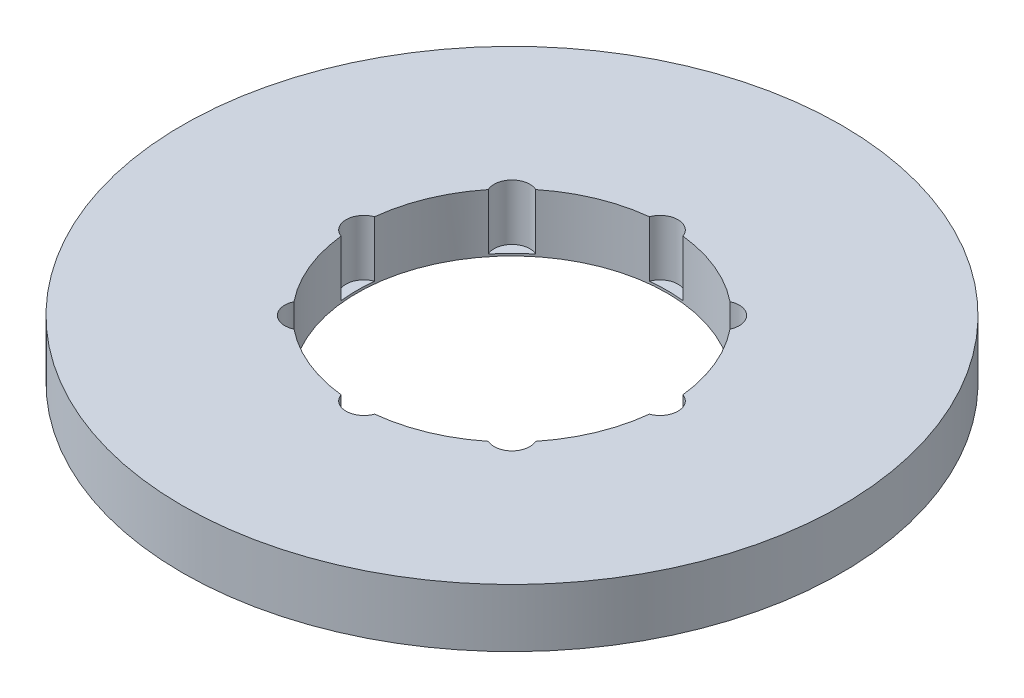
ISO-10303-21;
HEADER;
FILE_DESCRIPTION(('STEP AP214'),'2;1');
FILE_NAME('part.step','',(''),(''),'','','');
FILE_SCHEMA(('AUTOMOTIVE_DESIGN { 1 0 10303 214 1 1 1 1 }'));
ENDSEC;
DATA;
#1=APPLICATION_CONTEXT('core data for automotive mechanical design processes');
#2=APPLICATION_PROTOCOL_DEFINITION('international standard','automotive_design',2000,#1);
#3=PRODUCT_CONTEXT('',#1,'mechanical');
#4=PRODUCT('Part','Part','',(#3));
#5=PRODUCT_RELATED_PRODUCT_CATEGORY('part','',(#4));
#6=PRODUCT_DEFINITION_FORMATION('','',#4);
#7=PRODUCT_DEFINITION_CONTEXT('part definition',#1,'design');
#8=PRODUCT_DEFINITION('design','',#6,#7);
#9=PRODUCT_DEFINITION_SHAPE('','',#8);
#10=(LENGTH_UNIT() NAMED_UNIT(*) SI_UNIT(.MILLI.,.METRE.));
#11=(NAMED_UNIT(*) PLANE_ANGLE_UNIT() SI_UNIT($,.RADIAN.));
#12=(NAMED_UNIT(*) SI_UNIT($,.STERADIAN.) SOLID_ANGLE_UNIT());
#13=UNCERTAINTY_MEASURE_WITH_UNIT(LENGTH_MEASURE(1.E-05),#10,'distance_accuracy_value','');
#14=(GEOMETRIC_REPRESENTATION_CONTEXT(3) GLOBAL_UNCERTAINTY_ASSIGNED_CONTEXT((#13)) GLOBAL_UNIT_ASSIGNED_CONTEXT((#10,
#11,#12)) REPRESENTATION_CONTEXT('',''));
#15=CARTESIAN_POINT('',(0.,0.,0.));
#16=DIRECTION('',(0.,0.,1.));
#17=DIRECTION('',(1.,0.,0.));
#18=AXIS2_PLACEMENT_3D('',#15,#16,#17);
#19=CARTESIAN_POINT('',(0.,15.,0.));
#20=DIRECTION('',(0.,-1.,0.));
#21=DIRECTION('',(0.,0.,-1.));
#22=AXIS2_PLACEMENT_3D('',#19,#20,#21);
#23=CYLINDRICAL_SURFACE('',#22,85.);
#24=CARTESIAN_POINT('',(0.,15.,0.));
#25=DIRECTION('',(0.,1.,0.));
#26=DIRECTION('',(0.,0.,1.));
#27=AXIS2_PLACEMENT_3D('',#24,#25,#26);
#28=CIRCLE('',#27,85.);
#29=CARTESIAN_POINT('',(0.,15.,85.));
#30=VERTEX_POINT('',#29);
#31=EDGE_CURVE('E183',#30,#30,#28,.T.);
#32=ORIENTED_EDGE('',*,*,#31,.F.);
#33=EDGE_LOOP('',(#32));
#34=FACE_BOUND('',#33,.T.);
#35=CARTESIAN_POINT('',(0.,0.,0.));
#36=DIRECTION('',(0.,1.,0.));
#37=DIRECTION('',(0.,0.,1.));
#38=AXIS2_PLACEMENT_3D('',#35,#36,#37);
#39=CIRCLE('',#38,85.);
#40=CARTESIAN_POINT('',(0.,0.,85.));
#41=VERTEX_POINT('',#40);
#42=EDGE_CURVE('E182',#41,#41,#39,.T.);
#43=ORIENTED_EDGE('',*,*,#42,.T.);
#44=EDGE_LOOP('',(#43));
#45=FACE_BOUND('',#44,.T.);
#46=ADVANCED_FACE('F39',(#34,#45),#23,.T.);
#47=CARTESIAN_POINT('',(0.,15.,0.));
#48=DIRECTION('',(0.,1.,0.));
#49=DIRECTION('',(0.,0.,1.));
#50=AXIS2_PLACEMENT_3D('',#47,#48,#49);
#51=PLANE('',#50);
#52=CARTESIAN_POINT('',(1.33326199653173E-13,15.,38.1861412718732));
#53=DIRECTION('',(0.,1.,0.));
#54=DIRECTION('',(1.,0.,0.));
#55=AXIS2_PLACEMENT_3D('',#52,#53,#54);
#56=CIRCLE('',#55,4.60859700612872);
#57=CARTESIAN_POINT('',(-4.32971563613715,15.,39.7649790960613));
#58=VERTEX_POINT('',#57);
#59=CARTESIAN_POINT('',(4.32971563613742,15.,39.7649790960612));
#60=VERTEX_POINT('',#59);
#61=EDGE_CURVE('E256',#58,#60,#56,.T.);
#62=ORIENTED_EDGE('',*,*,#61,.F.);
#63=CARTESIAN_POINT('',(0.,15.,0.));
#64=DIRECTION('',(0.,1.,0.));
#65=DIRECTION('',(0.,0.,1.));
#66=AXIS2_PLACEMENT_3D('',#63,#64,#65);
#67=CIRCLE('',#66,40.);
#68=CARTESIAN_POINT('',(-25.0565150856441,15.,31.1796576594884));
#69=VERTEX_POINT('',#68);
#70=EDGE_CURVE('E175',#69,#58,#67,.T.);
#71=ORIENTED_EDGE('',*,*,#70,.F.);
#72=CARTESIAN_POINT('',(-27.001679440689,15.,27.0016794406891));
#73=DIRECTION('',(0.,1.,0.));
#74=DIRECTION('',(0.707106781186549,0.,0.707106781186546));
#75=AXIS2_PLACEMENT_3D('',#72,#73,#74);
#76=CIRCLE('',#75,4.60859700612872);
#77=CARTESIAN_POINT('',(-31.1796576594883,15.,25.0565150856442));
#78=VERTEX_POINT('',#77);
#79=EDGE_CURVE('E152',#78,#69,#76,.T.);
#80=ORIENTED_EDGE('',*,*,#79,.F.);
#81=CARTESIAN_POINT('',(-39.7649790960612,15.,4.32971563613729));
#82=VERTEX_POINT('',#81);
#83=EDGE_CURVE('E168',#82,#78,#67,.T.);
#84=ORIENTED_EDGE('',*,*,#83,.F.);
#85=CARTESIAN_POINT('',(-38.1861412718732,15.,0.));
#86=DIRECTION('',(0.,1.,0.));
#87=DIRECTION('',(0.,0.,1.));
#88=AXIS2_PLACEMENT_3D('',#85,#86,#87);
#89=CIRCLE('',#88,4.60859700612872);
#90=CARTESIAN_POINT('',(-39.7649790960612,15.,-4.32971563613729));
#91=VERTEX_POINT('',#90);
#92=EDGE_CURVE('E205',#91,#82,#89,.T.);
#93=ORIENTED_EDGE('',*,*,#92,.F.);
#94=CARTESIAN_POINT('',(-31.1796576594886,15.,-25.0565150856437));
#95=VERTEX_POINT('',#94);
#96=EDGE_CURVE('E181',#95,#91,#67,.T.);
#97=ORIENTED_EDGE('',*,*,#96,.F.);
#98=CARTESIAN_POINT('',(-27.0016794406894,15.,-27.0016794406887));
#99=DIRECTION('',(0.,1.,0.));
#100=DIRECTION('',(-0.707106781186539,0.,0.707106781186556));
#101=AXIS2_PLACEMENT_3D('',#98,#99,#100);
#102=CIRCLE('',#101,4.60859700612872);
#103=CARTESIAN_POINT('',(-25.0565150856445,15.,-31.179657659488));
#104=VERTEX_POINT('',#103);
#105=EDGE_CURVE('E453',#104,#95,#102,.T.);
#106=ORIENTED_EDGE('',*,*,#105,.F.);
#107=CARTESIAN_POINT('',(-4.3297156361377,15.,-39.7649790960612));
#108=VERTEX_POINT('',#107);
#109=EDGE_CURVE('E189',#108,#104,#67,.T.);
#110=ORIENTED_EDGE('',*,*,#109,.F.);
#111=CARTESIAN_POINT('',(-3.99978598959519E-13,15.,-38.1861412718732));
#112=DIRECTION('',(0.,1.,0.));
#113=DIRECTION('',(-1.,0.,0.));
#114=AXIS2_PLACEMENT_3D('',#111,#112,#113);
#115=CIRCLE('',#114,4.60859700612872);
#116=CARTESIAN_POINT('',(4.32971563613687,15.,-39.7649790960613));
#117=VERTEX_POINT('',#116);
#118=EDGE_CURVE('E462',#117,#108,#115,.T.);
#119=ORIENTED_EDGE('',*,*,#118,.F.);
#120=CARTESIAN_POINT('',(25.0565150856438,15.,-31.1796576594885));
#121=VERTEX_POINT('',#120);
#122=EDGE_CURVE('E197',#121,#117,#67,.T.);
#123=ORIENTED_EDGE('',*,*,#122,.F.);
#124=CARTESIAN_POINT('',(27.0016794406888,15.,-27.0016794406893));
#125=DIRECTION('',(0.,1.,0.));
#126=DIRECTION('',(-0.707106781186554,0.,-0.707106781186541));
#127=AXIS2_PLACEMENT_3D('',#124,#125,#126);
#128=CIRCLE('',#127,4.60859700612872);
#129=CARTESIAN_POINT('',(31.1796576594881,15.,-25.0565150856444));
#130=VERTEX_POINT('',#129);
#131=EDGE_CURVE('E470',#130,#121,#128,.T.);
#132=ORIENTED_EDGE('',*,*,#131,.F.);
#133=CARTESIAN_POINT('',(39.7649790960612,15.,-4.32971563613729));
#134=VERTEX_POINT('',#133);
#135=EDGE_CURVE('E489',#134,#130,#67,.T.);
#136=ORIENTED_EDGE('',*,*,#135,.F.);
#137=CARTESIAN_POINT('',(38.1861412718732,15.,0.));
#138=DIRECTION('',(0.,1.,0.));
#139=DIRECTION('',(0.,0.,-1.));
#140=AXIS2_PLACEMENT_3D('',#137,#138,#139);
#141=CIRCLE('',#140,4.60859700612872);
#142=CARTESIAN_POINT('',(39.7649790960612,15.,4.32971563613729));
#143=VERTEX_POINT('',#142);
#144=EDGE_CURVE('E476',#143,#134,#141,.T.);
#145=ORIENTED_EDGE('',*,*,#144,.F.);
#146=CARTESIAN_POINT('',(31.1796576594884,15.,25.056515085644));
#147=VERTEX_POINT('',#146);
#148=EDGE_CURVE('E491',#147,#143,#67,.T.);
#149=ORIENTED_EDGE('',*,*,#148,.F.);
#150=CARTESIAN_POINT('',(27.0016794406892,15.,27.0016794406889));
#151=DIRECTION('',(0.,1.,0.));
#152=DIRECTION('',(0.707106781186544,0.,-0.707106781186551));
#153=AXIS2_PLACEMENT_3D('',#150,#151,#152);
#154=CIRCLE('',#153,4.60859700612872);
#155=CARTESIAN_POINT('',(25.0565150856443,15.,31.1796576594882));
#156=VERTEX_POINT('',#155);
#157=EDGE_CURVE('E475',#156,#147,#154,.T.);
#158=ORIENTED_EDGE('',*,*,#157,.F.);
#159=EDGE_CURVE('E190',#60,#156,#67,.T.);
#160=ORIENTED_EDGE('',*,*,#159,.F.);
#161=EDGE_LOOP('',(#62,#71,#80,#84,#93,#97,#106,#110,#119,#123,#132,#136,#145,#149,#158,#160));
#162=FACE_BOUND('',#161,.T.);
#163=ORIENTED_EDGE('',*,*,#31,.T.);
#164=EDGE_LOOP('',(#163));
#165=FACE_BOUND('',#164,.T.);
#166=ADVANCED_FACE('F170',(#162,#165),#51,.T.);
#167=CARTESIAN_POINT('',(0.,0.,0.));
#168=DIRECTION('',(0.,1.,0.));
#169=DIRECTION('',(0.,0.,1.));
#170=AXIS2_PLACEMENT_3D('',#167,#168,#169);
#171=PLANE('',#170);
#172=CARTESIAN_POINT('',(0.,0.,0.));
#173=DIRECTION('',(0.,1.,0.));
#174=DIRECTION('',(0.,0.,1.));
#175=AXIS2_PLACEMENT_3D('',#172,#173,#174);
#176=CIRCLE('',#175,40.);
#177=CARTESIAN_POINT('',(0.,0.,40.));
#178=VERTEX_POINT('',#177);
#179=EDGE_CURVE('E191',#178,#178,#176,.T.);
#180=ORIENTED_EDGE('',*,*,#179,.T.);
#181=EDGE_LOOP('',(#180));
#182=FACE_BOUND('',#181,.T.);
#183=ORIENTED_EDGE('',*,*,#42,.F.);
#184=EDGE_LOOP('',(#183));
#185=FACE_BOUND('',#184,.T.);
#186=ADVANCED_FACE('F277',(#182,#185),#171,.F.);
#187=CARTESIAN_POINT('',(0.,15.,0.));
#188=DIRECTION('',(0.,-1.,0.));
#189=DIRECTION('',(0.,0.,-1.));
#190=AXIS2_PLACEMENT_3D('',#187,#188,#189);
#191=CYLINDRICAL_SURFACE('',#190,40.);
#192=DIRECTION('',(0.,1.,0.));
#193=VECTOR('',#192,1.);
#194=CARTESIAN_POINT('',(-4.32971563613715,7.79672360549239,39.7649790960612));
#195=LINE('',#194,#193);
#196=CARTESIAN_POINT('',(-4.32971563613715,0.593447210984775,39.7649790960613));
#197=VERTEX_POINT('',#196);
#198=EDGE_CURVE('E11',#197,#58,#195,.T.);
#199=ORIENTED_EDGE('',*,*,#198,.F.);
#200=CARTESIAN_POINT('',(0.,0.593447210984775,0.));
#201=DIRECTION('',(0.,1.,0.));
#202=DIRECTION('',(0.,0.,1.));
#203=AXIS2_PLACEMENT_3D('',#200,#201,#202);
#204=CIRCLE('',#203,40.);
#205=CARTESIAN_POINT('',(4.32971563613742,0.593447210984775,39.7649790960612));
#206=VERTEX_POINT('',#205);
#207=EDGE_CURVE('E251',#197,#206,#204,.T.);
#208=ORIENTED_EDGE('',*,*,#207,.T.);
#209=DIRECTION('',(0.,1.,0.));
#210=VECTOR('',#209,1.);
#211=CARTESIAN_POINT('',(4.32971563613743,7.79672360549239,39.7649790960612));
#212=LINE('',#211,#210);
#213=EDGE_CURVE('E46',#60,#206,#212,.F.);
#214=ORIENTED_EDGE('',*,*,#213,.F.);
#215=ORIENTED_EDGE('',*,*,#159,.T.);
#216=DIRECTION('',(0.,1.,0.));
#217=VECTOR('',#216,1.);
#218=CARTESIAN_POINT('',(25.0565150856443,7.79672360549239,31.1796576594882));
#219=LINE('',#218,#217);
#220=CARTESIAN_POINT('',(25.0565150856443,0.593447210984775,31.1796576594882));
#221=VERTEX_POINT('',#220);
#222=EDGE_CURVE('E253',#221,#156,#219,.T.);
#223=ORIENTED_EDGE('',*,*,#222,.F.);
#224=CARTESIAN_POINT('',(0.,0.593447210984775,0.));
#225=DIRECTION('',(0.,1.,0.));
#226=DIRECTION('',(0.,0.,1.));
#227=AXIS2_PLACEMENT_3D('',#224,#225,#226);
#228=CIRCLE('',#227,40.);
#229=CARTESIAN_POINT('',(31.1796576594884,0.593447210984775,25.056515085644));
#230=VERTEX_POINT('',#229);
#231=EDGE_CURVE('E246',#221,#230,#228,.T.);
#232=ORIENTED_EDGE('',*,*,#231,.T.);
#233=DIRECTION('',(0.,1.,0.));
#234=VECTOR('',#233,1.);
#235=CARTESIAN_POINT('',(31.1796576594884,7.79672360549239,25.0565150856439));
#236=LINE('',#235,#234);
#237=EDGE_CURVE('E248',#147,#230,#236,.F.);
#238=ORIENTED_EDGE('',*,*,#237,.F.);
#239=ORIENTED_EDGE('',*,*,#148,.T.);
#240=DIRECTION('',(0.,1.,0.));
#241=VECTOR('',#240,1.);
#242=CARTESIAN_POINT('',(39.7649790960612,7.79672360549239,4.32971563613729));
#243=LINE('',#242,#241);
#244=CARTESIAN_POINT('',(39.7649790960612,0.593447210984775,4.32971563613729));
#245=VERTEX_POINT('',#244);
#246=EDGE_CURVE('E243',#245,#143,#243,.T.);
#247=ORIENTED_EDGE('',*,*,#246,.F.);
#248=CARTESIAN_POINT('',(0.,0.593447210984775,0.));
#249=DIRECTION('',(0.,1.,0.));
#250=DIRECTION('',(0.,0.,1.));
#251=AXIS2_PLACEMENT_3D('',#248,#249,#250);
#252=CIRCLE('',#251,40.);
#253=CARTESIAN_POINT('',(39.7649790960612,0.593447210984775,-4.32971563613729));
#254=VERTEX_POINT('',#253);
#255=EDGE_CURVE('E236',#245,#254,#252,.T.);
#256=ORIENTED_EDGE('',*,*,#255,.T.);
#257=DIRECTION('',(0.,1.,0.));
#258=VECTOR('',#257,1.);
#259=CARTESIAN_POINT('',(39.7649790960612,7.79672360549239,-4.32971563613729));
#260=LINE('',#259,#258);
#261=EDGE_CURVE('E241',#134,#254,#260,.F.);
#262=ORIENTED_EDGE('',*,*,#261,.F.);
#263=ORIENTED_EDGE('',*,*,#135,.T.);
#264=DIRECTION('',(0.,1.,0.));
#265=VECTOR('',#264,1.);
#266=CARTESIAN_POINT('',(31.1796576594881,7.79672360549239,-25.0565150856444));
#267=LINE('',#266,#265);
#268=CARTESIAN_POINT('',(31.1796576594881,0.593447210984775,-25.0565150856444));
#269=VERTEX_POINT('',#268);
#270=EDGE_CURVE('E237',#269,#130,#267,.T.);
#271=ORIENTED_EDGE('',*,*,#270,.F.);
#272=CARTESIAN_POINT('',(0.,0.593447210984775,0.));
#273=DIRECTION('',(0.,1.,0.));
#274=DIRECTION('',(0.,0.,1.));
#275=AXIS2_PLACEMENT_3D('',#272,#273,#274);
#276=CIRCLE('',#275,40.);
#277=CARTESIAN_POINT('',(25.0565150856438,0.593447210984775,-31.1796576594885));
#278=VERTEX_POINT('',#277);
#279=EDGE_CURVE('E229',#269,#278,#276,.T.);
#280=ORIENTED_EDGE('',*,*,#279,.T.);
#281=DIRECTION('',(0.,1.,0.));
#282=VECTOR('',#281,1.);
#283=CARTESIAN_POINT('',(25.0565150856438,7.79672360549239,-31.1796576594885));
#284=LINE('',#283,#282);
#285=EDGE_CURVE('E232',#121,#278,#284,.F.);
#286=ORIENTED_EDGE('',*,*,#285,.F.);
#287=ORIENTED_EDGE('',*,*,#122,.T.);
#288=DIRECTION('',(0.,1.,0.));
#289=VECTOR('',#288,1.);
#290=CARTESIAN_POINT('',(4.32971563613687,7.79672360549239,-39.7649790960613));
#291=LINE('',#290,#289);
#292=CARTESIAN_POINT('',(4.32971563613687,0.593447210984775,-39.7649790960613));
#293=VERTEX_POINT('',#292);
#294=EDGE_CURVE('E227',#293,#117,#291,.T.);
#295=ORIENTED_EDGE('',*,*,#294,.F.);
#296=CARTESIAN_POINT('',(0.,0.593447210984775,0.));
#297=DIRECTION('',(0.,1.,0.));
#298=DIRECTION('',(0.,0.,1.));
#299=AXIS2_PLACEMENT_3D('',#296,#297,#298);
#300=CIRCLE('',#299,40.);
#301=CARTESIAN_POINT('',(-4.3297156361377,0.593447210984775,-39.7649790960612));
#302=VERTEX_POINT('',#301);
#303=EDGE_CURVE('E225',#293,#302,#300,.T.);
#304=ORIENTED_EDGE('',*,*,#303,.T.);
#305=DIRECTION('',(0.,1.,0.));
#306=VECTOR('',#305,1.);
#307=CARTESIAN_POINT('',(-4.32971563613771,7.79672360549239,-39.7649790960612));
#308=LINE('',#307,#306);
#309=EDGE_CURVE('E223',#108,#302,#308,.F.);
#310=ORIENTED_EDGE('',*,*,#309,.F.);
#311=ORIENTED_EDGE('',*,*,#109,.T.);
#312=DIRECTION('',(0.,1.,0.));
#313=VECTOR('',#312,1.);
#314=CARTESIAN_POINT('',(-25.0565150856445,7.79672360549239,-31.179657659488));
#315=LINE('',#314,#313);
#316=CARTESIAN_POINT('',(-25.0565150856445,0.593447210984775,-31.179657659488));
#317=VERTEX_POINT('',#316);
#318=EDGE_CURVE('E219',#317,#104,#315,.T.);
#319=ORIENTED_EDGE('',*,*,#318,.F.);
#320=CARTESIAN_POINT('',(0.,0.593447210984775,0.));
#321=DIRECTION('',(0.,1.,0.));
#322=DIRECTION('',(0.,0.,1.));
#323=AXIS2_PLACEMENT_3D('',#320,#321,#322);
#324=CIRCLE('',#323,40.);
#325=CARTESIAN_POINT('',(-31.1796576594886,0.593447210984775,-25.0565150856437));
#326=VERTEX_POINT('',#325);
#327=EDGE_CURVE('E159',#317,#326,#324,.T.);
#328=ORIENTED_EDGE('',*,*,#327,.T.);
#329=DIRECTION('',(0.,1.,0.));
#330=VECTOR('',#329,1.);
#331=CARTESIAN_POINT('',(-31.1796576594886,7.79672360549239,-25.0565150856437));
#332=LINE('',#331,#330);
#333=EDGE_CURVE('E220',#95,#326,#332,.F.);
#334=ORIENTED_EDGE('',*,*,#333,.F.);
#335=ORIENTED_EDGE('',*,*,#96,.T.);
#336=DIRECTION('',(0.,1.,0.));
#337=VECTOR('',#336,1.);
#338=CARTESIAN_POINT('',(-39.7649790960612,7.79672360549239,-4.32971563613729));
#339=LINE('',#338,#337);
#340=CARTESIAN_POINT('',(-39.7649790960612,0.593447210984775,-4.32971563613729));
#341=VERTEX_POINT('',#340);
#342=EDGE_CURVE('E209',#341,#91,#339,.T.);
#343=ORIENTED_EDGE('',*,*,#342,.F.);
#344=CARTESIAN_POINT('',(0.,0.593447210984775,0.));
#345=DIRECTION('',(0.,1.,0.));
#346=DIRECTION('',(0.,0.,1.));
#347=AXIS2_PLACEMENT_3D('',#344,#345,#346);
#348=CIRCLE('',#347,40.);
#349=CARTESIAN_POINT('',(-39.7649790960612,0.593447210984775,4.32971563613729));
#350=VERTEX_POINT('',#349);
#351=EDGE_CURVE('E206',#341,#350,#348,.T.);
#352=ORIENTED_EDGE('',*,*,#351,.T.);
#353=DIRECTION('',(0.,1.,0.));
#354=VECTOR('',#353,1.);
#355=CARTESIAN_POINT('',(-39.7649790960612,7.79672360549239,4.32971563613729));
#356=LINE('',#355,#354);
#357=EDGE_CURVE('E179',#82,#350,#356,.F.);
#358=ORIENTED_EDGE('',*,*,#357,.F.);
#359=ORIENTED_EDGE('',*,*,#83,.T.);
#360=DIRECTION('',(0.,1.,0.));
#361=VECTOR('',#360,1.);
#362=CARTESIAN_POINT('',(-31.1796576594883,7.79672360549239,25.0565150856442));
#363=LINE('',#362,#361);
#364=CARTESIAN_POINT('',(-31.1796576594883,0.593447210984775,25.0565150856442));
#365=VERTEX_POINT('',#364);
#366=EDGE_CURVE('E147',#365,#78,#363,.T.);
#367=ORIENTED_EDGE('',*,*,#366,.F.);
#368=CARTESIAN_POINT('',(0.,0.593447210984775,0.));
#369=DIRECTION('',(0.,1.,0.));
#370=DIRECTION('',(0.,0.,1.));
#371=AXIS2_PLACEMENT_3D('',#368,#369,#370);
#372=CIRCLE('',#371,40.);
#373=CARTESIAN_POINT('',(-25.0565150856441,0.593447210984775,31.1796576594884));
#374=VERTEX_POINT('',#373);
#375=EDGE_CURVE('E215',#365,#374,#372,.T.);
#376=ORIENTED_EDGE('',*,*,#375,.T.);
#377=DIRECTION('',(0.,1.,0.));
#378=VECTOR('',#377,1.);
#379=CARTESIAN_POINT('',(-25.056515085644,7.79672360549239,31.1796576594884));
#380=LINE('',#379,#378);
#381=EDGE_CURVE('E161',#69,#374,#380,.F.);
#382=ORIENTED_EDGE('',*,*,#381,.F.);
#383=ORIENTED_EDGE('',*,*,#70,.T.);
#384=EDGE_LOOP('',(#199,#208,#214,#215,#223,#232,#238,#239,#247,#256,#262,#263,#271,#280,#286,
#287,#295,#304,#310,#311,#319,#328,#334,#335,#343,#352,#358,#359,#367,#376,#382,#383));
#385=FACE_BOUND('',#384,.T.);
#386=ORIENTED_EDGE('',*,*,#179,.F.);
#387=EDGE_LOOP('',(#386));
#388=FACE_BOUND('',#387,.T.);
#389=ADVANCED_FACE('F176',(#385,#388),#191,.F.);
#390=CARTESIAN_POINT('',(-38.1861412718732,0.593447210984775,0.));
#391=DIRECTION('',(0.,1.,0.));
#392=DIRECTION('',(0.,0.,1.));
#393=AXIS2_PLACEMENT_3D('',#390,#391,#392);
#394=CYLINDRICAL_SURFACE('',#393,4.60859700612872);
#395=ORIENTED_EDGE('',*,*,#342,.T.);
#396=ORIENTED_EDGE('',*,*,#92,.T.);
#397=ORIENTED_EDGE('',*,*,#357,.T.);
#398=CARTESIAN_POINT('',(-38.1861412718732,0.593447210984775,0.));
#399=DIRECTION('',(0.,1.,0.));
#400=DIRECTION('',(0.,0.,1.));
#401=AXIS2_PLACEMENT_3D('',#398,#399,#400);
#402=CIRCLE('',#401,4.60859700612872);
#403=EDGE_CURVE('E200',#341,#350,#402,.T.);
#404=ORIENTED_EDGE('',*,*,#403,.F.);
#405=EDGE_LOOP('',(#395,#396,#397,#404));
#406=FACE_BOUND('',#405,.T.);
#407=ADVANCED_FACE('F286',(#406),#394,.F.);
#408=CARTESIAN_POINT('',(-38.1861412718732,0.593447210984775,0.));
#409=DIRECTION('',(0.,1.,0.));
#410=DIRECTION('',(0.,0.,1.));
#411=AXIS2_PLACEMENT_3D('',#408,#409,#410);
#412=PLANE('',#411);
#413=ORIENTED_EDGE('',*,*,#403,.T.);
#414=ORIENTED_EDGE('',*,*,#351,.F.);
#415=EDGE_LOOP('',(#413,#414));
#416=FACE_BOUND('',#415,.T.);
#417=ADVANCED_FACE('F289',(#416),#412,.T.);
#418=CARTESIAN_POINT('',(-27.001679440689,0.593447210984775,27.0016794406891));
#419=DIRECTION('',(0.,1.,0.));
#420=DIRECTION('',(0.,0.,1.));
#421=AXIS2_PLACEMENT_3D('',#418,#419,#420);
#422=CYLINDRICAL_SURFACE('',#421,4.60859700612872);
#423=ORIENTED_EDGE('',*,*,#366,.T.);
#424=ORIENTED_EDGE('',*,*,#79,.T.);
#425=ORIENTED_EDGE('',*,*,#381,.T.);
#426=CARTESIAN_POINT('',(-27.001679440689,0.593447210984775,27.0016794406891));
#427=DIRECTION('',(0.,1.,0.));
#428=DIRECTION('',(0.707106781186549,0.,0.707106781186546));
#429=AXIS2_PLACEMENT_3D('',#426,#427,#428);
#430=CIRCLE('',#429,4.60859700612872);
#431=EDGE_CURVE('E156',#365,#374,#430,.T.);
#432=ORIENTED_EDGE('',*,*,#431,.F.);
#433=EDGE_LOOP('',(#423,#424,#425,#432));
#434=FACE_BOUND('',#433,.T.);
#435=ADVANCED_FACE('F155',(#434),#422,.F.);
#436=CARTESIAN_POINT('',(-27.001679440689,0.593447210984775,27.0016794406891));
#437=DIRECTION('',(0.,1.,0.));
#438=DIRECTION('',(0.707106781186549,0.,0.707106781186546));
#439=AXIS2_PLACEMENT_3D('',#436,#437,#438);
#440=PLANE('',#439);
#441=ORIENTED_EDGE('',*,*,#431,.T.);
#442=ORIENTED_EDGE('',*,*,#375,.F.);
#443=EDGE_LOOP('',(#441,#442));
#444=FACE_BOUND('',#443,.T.);
#445=ADVANCED_FACE('F300',(#444),#440,.T.);
#446=CARTESIAN_POINT('',(-27.0016794406894,0.593447210984775,-27.0016794406887));
#447=DIRECTION('',(0.,1.,0.));
#448=DIRECTION('',(0.,0.,1.));
#449=AXIS2_PLACEMENT_3D('',#446,#447,#448);
#450=CYLINDRICAL_SURFACE('',#449,4.60859700612872);
#451=ORIENTED_EDGE('',*,*,#318,.T.);
#452=ORIENTED_EDGE('',*,*,#105,.T.);
#453=ORIENTED_EDGE('',*,*,#333,.T.);
#454=CARTESIAN_POINT('',(-27.0016794406894,0.593447210984775,-27.0016794406887));
#455=DIRECTION('',(0.,1.,0.));
#456=DIRECTION('',(-0.707106781186539,0.,0.707106781186556));
#457=AXIS2_PLACEMENT_3D('',#454,#455,#456);
#458=CIRCLE('',#457,4.60859700612872);
#459=EDGE_CURVE('E454',#317,#326,#458,.T.);
#460=ORIENTED_EDGE('',*,*,#459,.F.);
#461=EDGE_LOOP('',(#451,#452,#453,#460));
#462=FACE_BOUND('',#461,.T.);
#463=ADVANCED_FACE('F299',(#462),#450,.F.);
#464=CARTESIAN_POINT('',(-27.0016794406894,0.593447210984775,-27.0016794406887));
#465=DIRECTION('',(0.,1.,0.));
#466=DIRECTION('',(-0.707106781186539,0.,0.707106781186556));
#467=AXIS2_PLACEMENT_3D('',#464,#465,#466);
#468=PLANE('',#467);
#469=ORIENTED_EDGE('',*,*,#459,.T.);
#470=ORIENTED_EDGE('',*,*,#327,.F.);
#471=EDGE_LOOP('',(#469,#470));
#472=FACE_BOUND('',#471,.T.);
#473=ADVANCED_FACE('F379',(#472),#468,.T.);
#474=CARTESIAN_POINT('',(-3.99978598959519E-13,0.593447210984775,-38.1861412718732));
#475=DIRECTION('',(0.,1.,0.));
#476=DIRECTION('',(0.,0.,1.));
#477=AXIS2_PLACEMENT_3D('',#474,#475,#476);
#478=CYLINDRICAL_SURFACE('',#477,4.60859700612872);
#479=ORIENTED_EDGE('',*,*,#294,.T.);
#480=ORIENTED_EDGE('',*,*,#118,.T.);
#481=ORIENTED_EDGE('',*,*,#309,.T.);
#482=CARTESIAN_POINT('',(-3.99978598959519E-13,0.593447210984775,-38.1861412718732));
#483=DIRECTION('',(0.,1.,0.));
#484=DIRECTION('',(-1.,0.,0.));
#485=AXIS2_PLACEMENT_3D('',#482,#483,#484);
#486=CIRCLE('',#485,4.60859700612872);
#487=EDGE_CURVE('E465',#293,#302,#486,.T.);
#488=ORIENTED_EDGE('',*,*,#487,.F.);
#489=EDGE_LOOP('',(#479,#480,#481,#488));
#490=FACE_BOUND('',#489,.T.);
#491=ADVANCED_FACE('F371',(#490),#478,.F.);
#492=CARTESIAN_POINT('',(-3.99978598959519E-13,0.593447210984775,-38.1861412718732));
#493=DIRECTION('',(0.,1.,0.));
#494=DIRECTION('',(-1.,0.,0.));
#495=AXIS2_PLACEMENT_3D('',#492,#493,#494);
#496=PLANE('',#495);
#497=ORIENTED_EDGE('',*,*,#487,.T.);
#498=ORIENTED_EDGE('',*,*,#303,.F.);
#499=EDGE_LOOP('',(#497,#498));
#500=FACE_BOUND('',#499,.T.);
#501=ADVANCED_FACE('F308',(#500),#496,.T.);
#502=CARTESIAN_POINT('',(27.0016794406888,0.593447210984775,-27.0016794406893));
#503=DIRECTION('',(0.,1.,0.));
#504=DIRECTION('',(0.,0.,1.));
#505=AXIS2_PLACEMENT_3D('',#502,#503,#504);
#506=CYLINDRICAL_SURFACE('',#505,4.60859700612872);
#507=ORIENTED_EDGE('',*,*,#270,.T.);
#508=ORIENTED_EDGE('',*,*,#131,.T.);
#509=ORIENTED_EDGE('',*,*,#285,.T.);
#510=CARTESIAN_POINT('',(27.0016794406888,0.593447210984775,-27.0016794406893));
#511=DIRECTION('',(0.,1.,0.));
#512=DIRECTION('',(-0.707106781186554,0.,-0.707106781186541));
#513=AXIS2_PLACEMENT_3D('',#510,#511,#512);
#514=CIRCLE('',#513,4.60859700612872);
#515=EDGE_CURVE('E477',#269,#278,#514,.T.);
#516=ORIENTED_EDGE('',*,*,#515,.F.);
#517=EDGE_LOOP('',(#507,#508,#509,#516));
#518=FACE_BOUND('',#517,.T.);
#519=ADVANCED_FACE('F305',(#518),#506,.F.);
#520=CARTESIAN_POINT('',(27.0016794406888,0.593447210984775,-27.0016794406893));
#521=DIRECTION('',(0.,1.,0.));
#522=DIRECTION('',(-0.707106781186554,0.,-0.707106781186541));
#523=AXIS2_PLACEMENT_3D('',#520,#521,#522);
#524=PLANE('',#523);
#525=ORIENTED_EDGE('',*,*,#515,.T.);
#526=ORIENTED_EDGE('',*,*,#279,.F.);
#527=EDGE_LOOP('',(#525,#526));
#528=FACE_BOUND('',#527,.T.);
#529=ADVANCED_FACE('F304',(#528),#524,.T.);
#530=CARTESIAN_POINT('',(38.1861412718732,0.593447210984775,0.));
#531=DIRECTION('',(0.,1.,0.));
#532=DIRECTION('',(0.,0.,1.));
#533=AXIS2_PLACEMENT_3D('',#530,#531,#532);
#534=CYLINDRICAL_SURFACE('',#533,4.60859700612872);
#535=ORIENTED_EDGE('',*,*,#246,.T.);
#536=ORIENTED_EDGE('',*,*,#144,.T.);
#537=ORIENTED_EDGE('',*,*,#261,.T.);
#538=CARTESIAN_POINT('',(38.1861412718732,0.593447210984775,0.));
#539=DIRECTION('',(0.,1.,0.));
#540=DIRECTION('',(0.,0.,-1.));
#541=AXIS2_PLACEMENT_3D('',#538,#539,#540);
#542=CIRCLE('',#541,4.60859700612872);
#543=EDGE_CURVE('E478',#245,#254,#542,.T.);
#544=ORIENTED_EDGE('',*,*,#543,.F.);
#545=EDGE_LOOP('',(#535,#536,#537,#544));
#546=FACE_BOUND('',#545,.T.);
#547=ADVANCED_FACE('F309',(#546),#534,.F.);
#548=CARTESIAN_POINT('',(38.1861412718732,0.593447210984775,0.));
#549=DIRECTION('',(0.,1.,0.));
#550=DIRECTION('',(0.,0.,-1.));
#551=AXIS2_PLACEMENT_3D('',#548,#549,#550);
#552=PLANE('',#551);
#553=ORIENTED_EDGE('',*,*,#543,.T.);
#554=ORIENTED_EDGE('',*,*,#255,.F.);
#555=EDGE_LOOP('',(#553,#554));
#556=FACE_BOUND('',#555,.T.);
#557=ADVANCED_FACE('F314',(#556),#552,.T.);
#558=CARTESIAN_POINT('',(27.0016794406892,0.593447210984775,27.0016794406889));
#559=DIRECTION('',(0.,1.,0.));
#560=DIRECTION('',(0.,0.,1.));
#561=AXIS2_PLACEMENT_3D('',#558,#559,#560);
#562=CYLINDRICAL_SURFACE('',#561,4.60859700612872);
#563=ORIENTED_EDGE('',*,*,#222,.T.);
#564=ORIENTED_EDGE('',*,*,#157,.T.);
#565=ORIENTED_EDGE('',*,*,#237,.T.);
#566=CARTESIAN_POINT('',(27.0016794406892,0.593447210984775,27.0016794406889));
#567=DIRECTION('',(0.,1.,0.));
#568=DIRECTION('',(0.707106781186544,0.,-0.707106781186551));
#569=AXIS2_PLACEMENT_3D('',#566,#567,#568);
#570=CIRCLE('',#569,4.60859700612872);
#571=EDGE_CURVE('E56',#221,#230,#570,.T.);
#572=ORIENTED_EDGE('',*,*,#571,.F.);
#573=EDGE_LOOP('',(#563,#564,#565,#572));
#574=FACE_BOUND('',#573,.T.);
#575=ADVANCED_FACE('F318',(#574),#562,.F.);
#576=CARTESIAN_POINT('',(27.0016794406892,0.593447210984775,27.0016794406889));
#577=DIRECTION('',(0.,1.,0.));
#578=DIRECTION('',(0.707106781186544,0.,-0.707106781186551));
#579=AXIS2_PLACEMENT_3D('',#576,#577,#578);
#580=PLANE('',#579);
#581=ORIENTED_EDGE('',*,*,#571,.T.);
#582=ORIENTED_EDGE('',*,*,#231,.F.);
#583=EDGE_LOOP('',(#581,#582));
#584=FACE_BOUND('',#583,.T.);
#585=ADVANCED_FACE('F270',(#584),#580,.T.);
#586=CARTESIAN_POINT('',(1.33326199653173E-13,0.593447210984775,38.1861412718732));
#587=DIRECTION('',(0.,1.,0.));
#588=DIRECTION('',(0.,0.,1.));
#589=AXIS2_PLACEMENT_3D('',#586,#587,#588);
#590=CYLINDRICAL_SURFACE('',#589,4.60859700612872);
#591=ORIENTED_EDGE('',*,*,#198,.T.);
#592=ORIENTED_EDGE('',*,*,#61,.T.);
#593=ORIENTED_EDGE('',*,*,#213,.T.);
#594=CARTESIAN_POINT('',(1.33326199653173E-13,0.593447210984775,38.1861412718732));
#595=DIRECTION('',(0.,1.,0.));
#596=DIRECTION('',(1.,0.,0.));
#597=AXIS2_PLACEMENT_3D('',#594,#595,#596);
#598=CIRCLE('',#597,4.60859700612872);
#599=EDGE_CURVE('E55',#197,#206,#598,.T.);
#600=ORIENTED_EDGE('',*,*,#599,.F.);
#601=EDGE_LOOP('',(#591,#592,#593,#600));
#602=FACE_BOUND('',#601,.T.);
#603=ADVANCED_FACE('F260',(#602),#590,.F.);
#604=CARTESIAN_POINT('',(1.33326199653173E-13,0.593447210984775,38.1861412718732));
#605=DIRECTION('',(0.,1.,0.));
#606=DIRECTION('',(1.,0.,0.));
#607=AXIS2_PLACEMENT_3D('',#604,#605,#606);
#608=PLANE('',#607);
#609=ORIENTED_EDGE('',*,*,#599,.T.);
#610=ORIENTED_EDGE('',*,*,#207,.F.);
#611=EDGE_LOOP('',(#609,#610));
#612=FACE_BOUND('',#611,.T.);
#613=ADVANCED_FACE('F261',(#612),#608,.T.);
#614=CLOSED_SHELL('',(#46,#166,#186,#389,#407,#417,#435,#445,#463,#473,#491,#501,#519,#529,#547,
#557,#575,#585,#603,#613));
#615=MANIFOLD_SOLID_BREP('B2',#614);
#616=ADVANCED_BREP_SHAPE_REPRESENTATION('',(#18,#615),#14);
#617=SHAPE_DEFINITION_REPRESENTATION(#9,#616);
ENDSEC;
END-ISO-10303-21;
